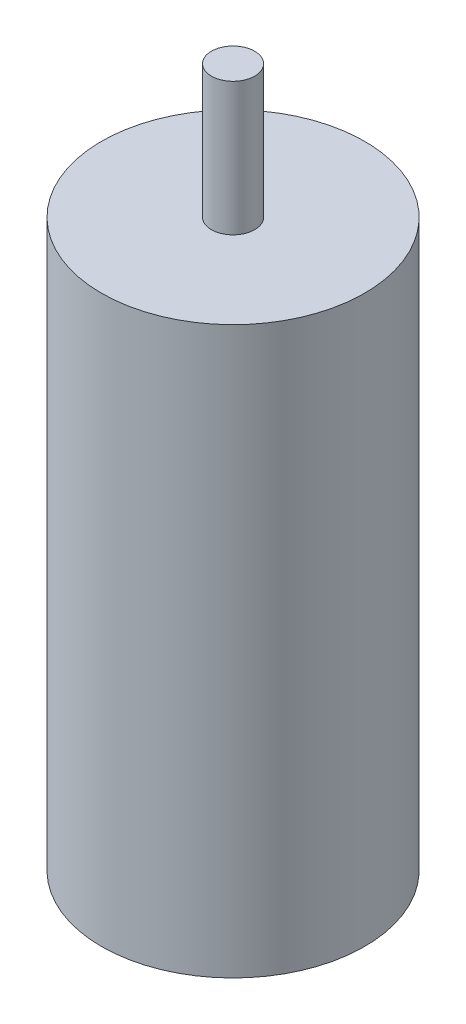
ISO-10303-21;
HEADER;
FILE_DESCRIPTION(('STEP AP214'),'2;1');
FILE_NAME('part.step','',(''),(''),'','','');
FILE_SCHEMA(('AUTOMOTIVE_DESIGN { 1 0 10303 214 1 1 1 1 }'));
ENDSEC;
DATA;
#1=APPLICATION_CONTEXT('core data for automotive mechanical design processes');
#2=APPLICATION_PROTOCOL_DEFINITION('international standard','automotive_design',2000,#1);
#3=PRODUCT_CONTEXT('',#1,'mechanical');
#4=PRODUCT('Part','Part','',(#3));
#5=PRODUCT_RELATED_PRODUCT_CATEGORY('part','',(#4));
#6=PRODUCT_DEFINITION_FORMATION('','',#4);
#7=PRODUCT_DEFINITION_CONTEXT('part definition',#1,'design');
#8=PRODUCT_DEFINITION('design','',#6,#7);
#9=PRODUCT_DEFINITION_SHAPE('','',#8);
#10=(LENGTH_UNIT() NAMED_UNIT(*) SI_UNIT(.MILLI.,.METRE.));
#11=(NAMED_UNIT(*) PLANE_ANGLE_UNIT() SI_UNIT($,.RADIAN.));
#12=(NAMED_UNIT(*) SI_UNIT($,.STERADIAN.) SOLID_ANGLE_UNIT());
#13=UNCERTAINTY_MEASURE_WITH_UNIT(LENGTH_MEASURE(1.E-05),#10,'distance_accuracy_value','');
#14=(GEOMETRIC_REPRESENTATION_CONTEXT(3) GLOBAL_UNCERTAINTY_ASSIGNED_CONTEXT((#13)) GLOBAL_UNIT_ASSIGNED_CONTEXT((#10,
#11,#12)) REPRESENTATION_CONTEXT('',''));
#15=CARTESIAN_POINT('',(0.,0.,0.));
#16=DIRECTION('',(0.,0.,1.));
#17=DIRECTION('',(1.,0.,0.));
#18=AXIS2_PLACEMENT_3D('',#15,#16,#17);
#19=CARTESIAN_POINT('',(0.,86.2339758212735,0.));
#20=DIRECTION('',(0.,-1.,0.));
#21=DIRECTION('',(0.,0.,-1.));
#22=AXIS2_PLACEMENT_3D('',#19,#20,#21);
#23=CYLINDRICAL_SURFACE('',#22,12.09675);
#24=CARTESIAN_POINT('',(0.,0.,0.));
#25=DIRECTION('',(0.,1.,0.));
#26=DIRECTION('',(0.,0.,1.));
#27=AXIS2_PLACEMENT_3D('',#24,#25,#26);
#28=CIRCLE('',#27,12.09675);
#29=CARTESIAN_POINT('',(0.,0.,12.09675));
#30=VERTEX_POINT('',#29);
#31=EDGE_CURVE('E51',#30,#30,#28,.T.);
#32=ORIENTED_EDGE('',*,*,#31,.T.);
#33=EDGE_LOOP('',(#32));
#34=FACE_BOUND('',#33,.T.);
#35=CARTESIAN_POINT('',(0.,52.0192,0.));
#36=DIRECTION('',(0.,1.,0.));
#37=DIRECTION('',(0.,0.,1.));
#38=AXIS2_PLACEMENT_3D('',#35,#36,#37);
#39=CIRCLE('',#38,12.09675);
#40=CARTESIAN_POINT('',(0.,52.0192,12.09675));
#41=VERTEX_POINT('',#40);
#42=EDGE_CURVE('E41',#41,#41,#39,.T.);
#43=ORIENTED_EDGE('',*,*,#42,.F.);
#44=EDGE_LOOP('',(#43));
#45=FACE_BOUND('',#44,.T.);
#46=ADVANCED_FACE('F37',(#34,#45),#23,.T.);
#47=CARTESIAN_POINT('',(0.,0.,0.));
#48=DIRECTION('',(0.,1.,0.));
#49=DIRECTION('',(0.,0.,1.));
#50=AXIS2_PLACEMENT_3D('',#47,#48,#49);
#51=PLANE('',#50);
#52=ORIENTED_EDGE('',*,*,#31,.F.);
#53=EDGE_LOOP('',(#52));
#54=FACE_BOUND('',#53,.T.);
#55=ADVANCED_FACE('F62',(#54),#51,.F.);
#56=CARTESIAN_POINT('',(0.,52.0192,0.));
#57=DIRECTION('',(0.,1.,0.));
#58=DIRECTION('',(0.,0.,1.));
#59=AXIS2_PLACEMENT_3D('',#56,#57,#58);
#60=PLANE('',#59);
#61=CARTESIAN_POINT('',(0.,52.0192,0.));
#62=DIRECTION('',(0.,1.,0.));
#63=DIRECTION('',(0.,0.,1.));
#64=AXIS2_PLACEMENT_3D('',#61,#62,#63);
#65=CIRCLE('',#64,1.98755);
#66=CARTESIAN_POINT('',(0.,52.0192,1.98755));
#67=VERTEX_POINT('',#66);
#68=EDGE_CURVE('E10',#67,#67,#65,.T.);
#69=ORIENTED_EDGE('',*,*,#68,.F.);
#70=EDGE_LOOP('',(#69));
#71=FACE_BOUND('',#70,.T.);
#72=ORIENTED_EDGE('',*,*,#42,.T.);
#73=EDGE_LOOP('',(#72));
#74=FACE_BOUND('',#73,.T.);
#75=ADVANCED_FACE('F39',(#71,#74),#60,.T.);
#76=CARTESIAN_POINT('',(0.,69.8709403317893,0.));
#77=DIRECTION('',(0.,-1.,0.));
#78=DIRECTION('',(0.,0.,-1.));
#79=AXIS2_PLACEMENT_3D('',#76,#77,#78);
#80=CYLINDRICAL_SURFACE('',#79,1.98755);
#81=ORIENTED_EDGE('',*,*,#68,.T.);
#82=EDGE_LOOP('',(#81));
#83=FACE_BOUND('',#82,.T.);
#84=CARTESIAN_POINT('',(0.,64.2493,0.));
#85=DIRECTION('',(0.,1.,0.));
#86=DIRECTION('',(0.,0.,1.));
#87=AXIS2_PLACEMENT_3D('',#84,#85,#86);
#88=CIRCLE('',#87,1.98755);
#89=CARTESIAN_POINT('',(0.,64.2493,1.98755));
#90=VERTEX_POINT('',#89);
#91=EDGE_CURVE('E53',#90,#90,#88,.T.);
#92=ORIENTED_EDGE('',*,*,#91,.F.);
#93=EDGE_LOOP('',(#92));
#94=FACE_BOUND('',#93,.T.);
#95=ADVANCED_FACE('F69',(#83,#94),#80,.T.);
#96=CARTESIAN_POINT('',(0.,64.2493,0.));
#97=DIRECTION('',(0.,1.,0.));
#98=DIRECTION('',(0.,0.,1.));
#99=AXIS2_PLACEMENT_3D('',#96,#97,#98);
#100=PLANE('',#99);
#101=ORIENTED_EDGE('',*,*,#91,.T.);
#102=EDGE_LOOP('',(#101));
#103=FACE_BOUND('',#102,.T.);
#104=ADVANCED_FACE('F72',(#103),#100,.T.);
#105=CLOSED_SHELL('',(#46,#55,#75,#95,#104));
#106=MANIFOLD_SOLID_BREP('B2',#105);
#107=ADVANCED_BREP_SHAPE_REPRESENTATION('',(#18,#106),#14);
#108=SHAPE_DEFINITION_REPRESENTATION(#9,#107);
ENDSEC;
END-ISO-10303-21;
